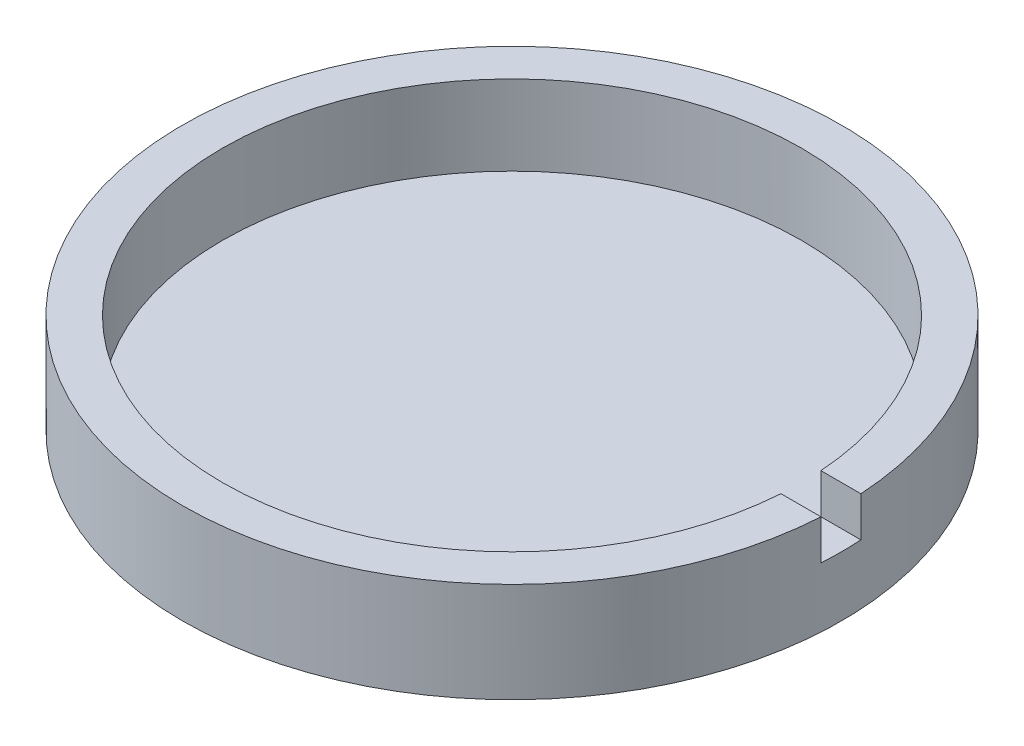
ISO-10303-21;
HEADER;
FILE_DESCRIPTION(('STEP AP214'),'2;1');
FILE_NAME('part.step','',(''),(''),'','','');
FILE_SCHEMA(('AUTOMOTIVE_DESIGN { 1 0 10303 214 1 1 1 1 }'));
ENDSEC;
DATA;
#1=APPLICATION_CONTEXT('core data for automotive mechanical design processes');
#2=APPLICATION_PROTOCOL_DEFINITION('international standard','automotive_design',2000,#1);
#3=PRODUCT_CONTEXT('',#1,'mechanical');
#4=PRODUCT('Part','Part','',(#3));
#5=PRODUCT_RELATED_PRODUCT_CATEGORY('part','',(#4));
#6=PRODUCT_DEFINITION_FORMATION('','',#4);
#7=PRODUCT_DEFINITION_CONTEXT('part definition',#1,'design');
#8=PRODUCT_DEFINITION('design','',#6,#7);
#9=PRODUCT_DEFINITION_SHAPE('','',#8);
#10=(LENGTH_UNIT() NAMED_UNIT(*) SI_UNIT(.MILLI.,.METRE.));
#11=(NAMED_UNIT(*) PLANE_ANGLE_UNIT() SI_UNIT($,.RADIAN.));
#12=(NAMED_UNIT(*) SI_UNIT($,.STERADIAN.) SOLID_ANGLE_UNIT());
#13=UNCERTAINTY_MEASURE_WITH_UNIT(LENGTH_MEASURE(1.E-05),#10,'distance_accuracy_value','');
#14=(GEOMETRIC_REPRESENTATION_CONTEXT(3) GLOBAL_UNCERTAINTY_ASSIGNED_CONTEXT((#13)) GLOBAL_UNIT_ASSIGNED_CONTEXT((#10,
#11,#12)) REPRESENTATION_CONTEXT('',''));
#15=CARTESIAN_POINT('',(0.,0.,0.));
#16=DIRECTION('',(0.,0.,1.));
#17=DIRECTION('',(1.,0.,0.));
#18=AXIS2_PLACEMENT_3D('',#15,#16,#17);
#19=CARTESIAN_POINT('',(0.,0.,0.));
#20=DIRECTION('',(0.,1.,0.));
#21=DIRECTION('',(0.,0.,1.));
#22=AXIS2_PLACEMENT_3D('',#19,#20,#21);
#23=PLANE('',#22);
#24=CARTESIAN_POINT('',(0.,0.,0.));
#25=DIRECTION('',(0.,1.,0.));
#26=DIRECTION('',(0.,0.,1.));
#27=AXIS2_PLACEMENT_3D('',#24,#25,#26);
#28=CIRCLE('',#27,16.5);
#29=CARTESIAN_POINT('',(0.,0.,16.5));
#30=VERTEX_POINT('',#29);
#31=EDGE_CURVE('E42',#30,#30,#28,.T.);
#32=ORIENTED_EDGE('',*,*,#31,.F.);
#33=EDGE_LOOP('',(#32));
#34=FACE_BOUND('',#33,.T.);
#35=ADVANCED_FACE('F35',(#34),#23,.F.);
#36=CARTESIAN_POINT('',(0.,0.999999999999998,0.));
#37=DIRECTION('',(0.,1.,0.));
#38=DIRECTION('',(0.,0.,1.));
#39=AXIS2_PLACEMENT_3D('',#36,#37,#38);
#40=CYLINDRICAL_SURFACE('',#39,16.5);
#41=CARTESIAN_POINT('',(0.,5.,0.));
#42=DIRECTION('',(0.,1.,0.));
#43=DIRECTION('',(0.,0.,1.));
#44=AXIS2_PLACEMENT_3D('',#41,#42,#43);
#45=CIRCLE('',#44,16.5);
#46=CARTESIAN_POINT('',(16.4696690920006,5.,-1.));
#47=VERTEX_POINT('',#46);
#48=CARTESIAN_POINT('',(16.4696690920006,5.,0.999999999999999));
#49=VERTEX_POINT('',#48);
#50=EDGE_CURVE('E105',#47,#49,#45,.T.);
#51=ORIENTED_EDGE('',*,*,#50,.F.);
#52=DIRECTION('',(0.,1.,0.));
#53=VECTOR('',#52,1.);
#54=CARTESIAN_POINT('',(16.4696690920006,0.999999999999998,-1.));
#55=LINE('',#54,#53);
#56=CARTESIAN_POINT('',(16.4696690920006,3.,-1.));
#57=VERTEX_POINT('',#56);
#58=EDGE_CURVE('E98',#47,#57,#55,.F.);
#59=ORIENTED_EDGE('',*,*,#58,.T.);
#60=CARTESIAN_POINT('',(0.,3.,0.));
#61=DIRECTION('',(0.,1.,0.));
#62=DIRECTION('',(0.,0.,1.));
#63=AXIS2_PLACEMENT_3D('',#60,#61,#62);
#64=CIRCLE('',#63,16.5);
#65=CARTESIAN_POINT('',(16.4696690920006,3.,0.999999999999999));
#66=VERTEX_POINT('',#65);
#67=EDGE_CURVE('E91',#66,#57,#64,.T.);
#68=ORIENTED_EDGE('',*,*,#67,.F.);
#69=DIRECTION('',(0.,1.,0.));
#70=VECTOR('',#69,1.);
#71=CARTESIAN_POINT('',(16.4696690920006,0.999999999999999,1.));
#72=LINE('',#71,#70);
#73=EDGE_CURVE('E57',#66,#49,#72,.T.);
#74=ORIENTED_EDGE('',*,*,#73,.T.);
#75=EDGE_LOOP('',(#51,#59,#68,#74));
#76=FACE_BOUND('',#75,.T.);
#77=ORIENTED_EDGE('',*,*,#31,.T.);
#78=EDGE_LOOP('',(#77));
#79=FACE_BOUND('',#78,.T.);
#80=ADVANCED_FACE('F110',(#76,#79),#40,.T.);
#81=CARTESIAN_POINT('',(0.,5.,-16.5));
#82=DIRECTION('',(0.,-1.,0.));
#83=DIRECTION('',(0.,0.,-1.));
#84=AXIS2_PLACEMENT_3D('',#81,#82,#83);
#85=PLANE('',#84);
#86=CARTESIAN_POINT('',(0.,5.,0.));
#87=DIRECTION('',(0.,1.,0.));
#88=DIRECTION('',(0.,0.,1.));
#89=AXIS2_PLACEMENT_3D('',#86,#87,#88);
#90=CIRCLE('',#89,14.5);
#91=CARTESIAN_POINT('',(14.4654761414894,5.,-1.));
#92=VERTEX_POINT('',#91);
#93=CARTESIAN_POINT('',(14.4654761414894,5.,0.999999999999999));
#94=VERTEX_POINT('',#93);
#95=EDGE_CURVE('E89',#92,#94,#90,.T.);
#96=ORIENTED_EDGE('',*,*,#95,.F.);
#97=DIRECTION('',(-1.,0.,0.));
#98=VECTOR('',#97,1.);
#99=CARTESIAN_POINT('',(14.4654761414894,5.,-1.));
#100=LINE('',#99,#98);
#101=EDGE_CURVE('E84',#47,#92,#100,.T.);
#102=ORIENTED_EDGE('',*,*,#101,.F.);
#103=ORIENTED_EDGE('',*,*,#50,.T.);
#104=DIRECTION('',(1.,0.,0.));
#105=VECTOR('',#104,1.);
#106=CARTESIAN_POINT('',(14.4654761414894,5.,0.999999999999999));
#107=LINE('',#106,#105);
#108=EDGE_CURVE('E183',#94,#49,#107,.T.);
#109=ORIENTED_EDGE('',*,*,#108,.F.);
#110=EDGE_LOOP('',(#96,#102,#103,#109));
#111=FACE_BOUND('',#110,.T.);
#112=ADVANCED_FACE('F116',(#111),#85,.F.);
#113=CARTESIAN_POINT('',(0.,0.999999999999998,0.));
#114=DIRECTION('',(0.,1.,0.));
#115=DIRECTION('',(0.,0.,1.));
#116=AXIS2_PLACEMENT_3D('',#113,#114,#115);
#117=CYLINDRICAL_SURFACE('',#116,14.5);
#118=CARTESIAN_POINT('',(0.,1.,0.));
#119=DIRECTION('',(0.,1.,0.));
#120=DIRECTION('',(0.,0.,1.));
#121=AXIS2_PLACEMENT_3D('',#118,#119,#120);
#122=CIRCLE('',#121,14.5);
#123=CARTESIAN_POINT('',(0.,1.00000000000001,14.5));
#124=VERTEX_POINT('',#123);
#125=EDGE_CURVE('E101',#124,#124,#122,.T.);
#126=ORIENTED_EDGE('',*,*,#125,.F.);
#127=EDGE_LOOP('',(#126));
#128=FACE_BOUND('',#127,.T.);
#129=CARTESIAN_POINT('',(0.,3.,0.));
#130=DIRECTION('',(0.,1.,0.));
#131=DIRECTION('',(0.,0.,1.));
#132=AXIS2_PLACEMENT_3D('',#129,#130,#131);
#133=CIRCLE('',#132,14.5);
#134=CARTESIAN_POINT('',(14.4654761414894,3.,-1.));
#135=VERTEX_POINT('',#134);
#136=CARTESIAN_POINT('',(14.4654761414894,3.,0.999999999999999));
#137=VERTEX_POINT('',#136);
#138=EDGE_CURVE('E11',#135,#137,#133,.F.);
#139=ORIENTED_EDGE('',*,*,#138,.F.);
#140=DIRECTION('',(0.,1.,0.));
#141=VECTOR('',#140,1.);
#142=CARTESIAN_POINT('',(14.4654761414894,3.,-1.));
#143=LINE('',#142,#141);
#144=EDGE_CURVE('E49',#135,#92,#143,.T.);
#145=ORIENTED_EDGE('',*,*,#144,.T.);
#146=ORIENTED_EDGE('',*,*,#95,.T.);
#147=DIRECTION('',(0.,1.,0.));
#148=VECTOR('',#147,1.);
#149=CARTESIAN_POINT('',(14.4654761414894,3.,0.999999999999999));
#150=LINE('',#149,#148);
#151=EDGE_CURVE('E82',#137,#94,#150,.T.);
#152=ORIENTED_EDGE('',*,*,#151,.F.);
#153=EDGE_LOOP('',(#139,#145,#146,#152));
#154=FACE_BOUND('',#153,.T.);
#155=ADVANCED_FACE('F87',(#128,#154),#117,.F.);
#156=CARTESIAN_POINT('',(0.,0.999999999999998,-14.5));
#157=DIRECTION('',(0.,-1.,0.));
#158=DIRECTION('',(0.,0.,-1.));
#159=AXIS2_PLACEMENT_3D('',#156,#157,#158);
#160=PLANE('',#159);
#161=ORIENTED_EDGE('',*,*,#125,.T.);
#162=EDGE_LOOP('',(#161));
#163=FACE_BOUND('',#162,.T.);
#164=ADVANCED_FACE('F127',(#163),#160,.F.);
#165=CARTESIAN_POINT('',(14.4654761414894,3.,-1.));
#166=DIRECTION('',(0.,0.,-1.));
#167=DIRECTION('',(0.,1.,0.));
#168=AXIS2_PLACEMENT_3D('',#165,#166,#167);
#169=PLANE('',#168);
#170=ORIENTED_EDGE('',*,*,#101,.T.);
#171=ORIENTED_EDGE('',*,*,#144,.F.);
#172=DIRECTION('',(-1.,0.,0.));
#173=VECTOR('',#172,1.);
#174=CARTESIAN_POINT('',(14.4654761414894,3.,-1.));
#175=LINE('',#174,#173);
#176=EDGE_CURVE('E78',#57,#135,#175,.T.);
#177=ORIENTED_EDGE('',*,*,#176,.F.);
#178=ORIENTED_EDGE('',*,*,#58,.F.);
#179=EDGE_LOOP('',(#170,#171,#177,#178));
#180=FACE_BOUND('',#179,.T.);
#181=ADVANCED_FACE('F131',(#180),#169,.F.);
#182=CARTESIAN_POINT('',(14.4654761414894,3.,0.999999999999999));
#183=DIRECTION('',(0.,0.,1.));
#184=DIRECTION('',(0.,-1.,0.));
#185=AXIS2_PLACEMENT_3D('',#182,#183,#184);
#186=PLANE('',#185);
#187=DIRECTION('',(1.,0.,0.));
#188=VECTOR('',#187,1.);
#189=CARTESIAN_POINT('',(14.4654761414894,3.,0.999999999999999));
#190=LINE('',#189,#188);
#191=EDGE_CURVE('E76',#137,#66,#190,.T.);
#192=ORIENTED_EDGE('',*,*,#191,.F.);
#193=ORIENTED_EDGE('',*,*,#151,.T.);
#194=ORIENTED_EDGE('',*,*,#108,.T.);
#195=ORIENTED_EDGE('',*,*,#73,.F.);
#196=EDGE_LOOP('',(#192,#193,#194,#195));
#197=FACE_BOUND('',#196,.T.);
#198=ADVANCED_FACE('F81',(#197),#186,.F.);
#199=CARTESIAN_POINT('',(0.,3.,0.));
#200=DIRECTION('',(0.,1.,0.));
#201=DIRECTION('',(0.,0.,1.));
#202=AXIS2_PLACEMENT_3D('',#199,#200,#201);
#203=PLANE('',#202);
#204=ORIENTED_EDGE('',*,*,#67,.T.);
#205=ORIENTED_EDGE('',*,*,#176,.T.);
#206=ORIENTED_EDGE('',*,*,#138,.T.);
#207=ORIENTED_EDGE('',*,*,#191,.T.);
#208=EDGE_LOOP('',(#204,#205,#206,#207));
#209=FACE_BOUND('',#208,.T.);
#210=ADVANCED_FACE('F75',(#209),#203,.T.);
#211=CLOSED_SHELL('',(#35,#80,#112,#155,#164,#181,#198,#210));
#212=MANIFOLD_SOLID_BREP('B2',#211);
#213=ADVANCED_BREP_SHAPE_REPRESENTATION('',(#18,#212),#14);
#214=SHAPE_DEFINITION_REPRESENTATION(#9,#213);
ENDSEC;
END-ISO-10303-21;
